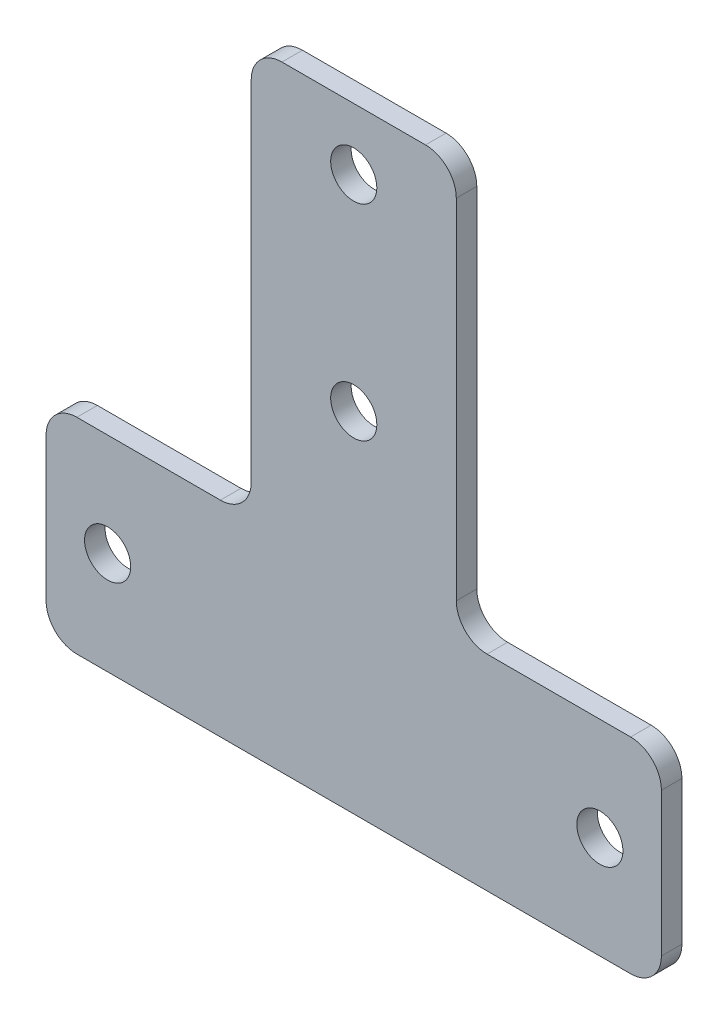
ISO-10303-21;
HEADER;
FILE_DESCRIPTION(('STEP AP214'),'2;1');
FILE_NAME('part.step','',(''),(''),'','','');
FILE_SCHEMA(('AUTOMOTIVE_DESIGN { 1 0 10303 214 1 1 1 1 }'));
ENDSEC;
DATA;
#1=APPLICATION_CONTEXT('core data for automotive mechanical design processes');
#2=APPLICATION_PROTOCOL_DEFINITION('international standard','automotive_design',2000,#1);
#3=PRODUCT_CONTEXT('',#1,'mechanical');
#4=PRODUCT('Part','Part','',(#3));
#5=PRODUCT_RELATED_PRODUCT_CATEGORY('part','',(#4));
#6=PRODUCT_DEFINITION_FORMATION('','',#4);
#7=PRODUCT_DEFINITION_CONTEXT('part definition',#1,'design');
#8=PRODUCT_DEFINITION('design','',#6,#7);
#9=PRODUCT_DEFINITION_SHAPE('','',#8);
#10=(LENGTH_UNIT() NAMED_UNIT(*) SI_UNIT(.MILLI.,.METRE.));
#11=(NAMED_UNIT(*) PLANE_ANGLE_UNIT() SI_UNIT($,.RADIAN.));
#12=(NAMED_UNIT(*) SI_UNIT($,.STERADIAN.) SOLID_ANGLE_UNIT());
#13=UNCERTAINTY_MEASURE_WITH_UNIT(LENGTH_MEASURE(1.E-05),#10,'distance_accuracy_value','');
#14=(GEOMETRIC_REPRESENTATION_CONTEXT(3) GLOBAL_UNCERTAINTY_ASSIGNED_CONTEXT((#13)) GLOBAL_UNIT_ASSIGNED_CONTEXT((#10,
#11,#12)) REPRESENTATION_CONTEXT('',''));
#15=CARTESIAN_POINT('',(0.,0.,0.));
#16=DIRECTION('',(0.,0.,1.));
#17=DIRECTION('',(1.,0.,0.));
#18=AXIS2_PLACEMENT_3D('',#15,#16,#17);
#19=CARTESIAN_POINT('',(13.,23.,-2.));
#20=DIRECTION('',(0.,0.,1.));
#21=DIRECTION('',(1.,0.,0.));
#22=AXIS2_PLACEMENT_3D('',#19,#20,#21);
#23=CYLINDRICAL_SURFACE('',#22,3.);
#24=CARTESIAN_POINT('',(13.,23.,0.));
#25=DIRECTION('',(0.,0.,-1.));
#26=DIRECTION('',(-1.,0.,0.));
#27=AXIS2_PLACEMENT_3D('',#24,#25,#26);
#28=CIRCLE('',#27,3.);
#29=CARTESIAN_POINT('',(13.,20.,0.));
#30=VERTEX_POINT('',#29);
#31=CARTESIAN_POINT('',(10.,23.,0.));
#32=VERTEX_POINT('',#31);
#33=EDGE_CURVE('E184',#30,#32,#28,.T.);
#34=ORIENTED_EDGE('',*,*,#33,.F.);
#35=DIRECTION('',(0.,0.,1.));
#36=VECTOR('',#35,1.);
#37=CARTESIAN_POINT('',(13.,20.,-2.));
#38=LINE('',#37,#36);
#39=CARTESIAN_POINT('',(13.,20.,-2.));
#40=VERTEX_POINT('',#39);
#41=EDGE_CURVE('E11',#40,#30,#38,.T.);
#42=ORIENTED_EDGE('',*,*,#41,.F.);
#43=CARTESIAN_POINT('',(13.,23.,-2.));
#44=DIRECTION('',(0.,0.,-1.));
#45=DIRECTION('',(-1.,0.,0.));
#46=AXIS2_PLACEMENT_3D('',#43,#44,#45);
#47=CIRCLE('',#46,3.);
#48=CARTESIAN_POINT('',(10.,23.,-2.));
#49=VERTEX_POINT('',#48);
#50=EDGE_CURVE('E229',#40,#49,#47,.T.);
#51=ORIENTED_EDGE('',*,*,#50,.T.);
#52=DIRECTION('',(0.,0.,1.));
#53=VECTOR('',#52,1.);
#54=CARTESIAN_POINT('',(10.,23.,-2.));
#55=LINE('',#54,#53);
#56=EDGE_CURVE('E43',#49,#32,#55,.T.);
#57=ORIENTED_EDGE('',*,*,#56,.T.);
#58=EDGE_LOOP('',(#34,#42,#51,#57));
#59=FACE_BOUND('',#58,.T.);
#60=ADVANCED_FACE('F40',(#59),#23,.F.);
#61=CARTESIAN_POINT('',(27.,20.,-2.));
#62=DIRECTION('',(0.,1.,0.));
#63=DIRECTION('',(-1.,0.,0.));
#64=AXIS2_PLACEMENT_3D('',#61,#62,#63);
#65=PLANE('',#64);
#66=DIRECTION('',(-1.,0.,0.));
#67=VECTOR('',#66,1.);
#68=CARTESIAN_POINT('',(27.,20.,0.));
#69=LINE('',#68,#67);
#70=CARTESIAN_POINT('',(27.,20.,0.));
#71=VERTEX_POINT('',#70);
#72=EDGE_CURVE('E227',#71,#30,#69,.T.);
#73=ORIENTED_EDGE('',*,*,#72,.F.);
#74=DIRECTION('',(0.,0.,1.));
#75=VECTOR('',#74,1.);
#76=CARTESIAN_POINT('',(27.,20.,-2.));
#77=LINE('',#76,#75);
#78=CARTESIAN_POINT('',(27.,20.,-2.));
#79=VERTEX_POINT('',#78);
#80=EDGE_CURVE('E49',#79,#71,#77,.T.);
#81=ORIENTED_EDGE('',*,*,#80,.F.);
#82=DIRECTION('',(-1.,0.,0.));
#83=VECTOR('',#82,1.);
#84=CARTESIAN_POINT('',(27.,20.,-2.));
#85=LINE('',#84,#83);
#86=EDGE_CURVE('E174',#79,#40,#85,.T.);
#87=ORIENTED_EDGE('',*,*,#86,.T.);
#88=ORIENTED_EDGE('',*,*,#41,.T.);
#89=EDGE_LOOP('',(#73,#81,#87,#88));
#90=FACE_BOUND('',#89,.T.);
#91=ADVANCED_FACE('F257',(#90),#65,.T.);
#92=CARTESIAN_POINT('',(27.,17.,-2.));
#93=DIRECTION('',(0.,0.,1.));
#94=DIRECTION('',(1.,0.,0.));
#95=AXIS2_PLACEMENT_3D('',#92,#93,#94);
#96=CYLINDRICAL_SURFACE('',#95,3.);
#97=CARTESIAN_POINT('',(27.,17.,0.));
#98=DIRECTION('',(0.,0.,1.));
#99=DIRECTION('',(1.,0.,0.));
#100=AXIS2_PLACEMENT_3D('',#97,#98,#99);
#101=CIRCLE('',#100,3.);
#102=CARTESIAN_POINT('',(30.,17.,0.));
#103=VERTEX_POINT('',#102);
#104=EDGE_CURVE('E161',#103,#71,#101,.T.);
#105=ORIENTED_EDGE('',*,*,#104,.F.);
#106=DIRECTION('',(0.,0.,1.));
#107=VECTOR('',#106,1.);
#108=CARTESIAN_POINT('',(30.,17.,-2.));
#109=LINE('',#108,#107);
#110=CARTESIAN_POINT('',(30.,17.,-2.));
#111=VERTEX_POINT('',#110);
#112=EDGE_CURVE('E156',#111,#103,#109,.T.);
#113=ORIENTED_EDGE('',*,*,#112,.F.);
#114=CARTESIAN_POINT('',(27.,17.,-2.));
#115=DIRECTION('',(0.,0.,1.));
#116=DIRECTION('',(1.,0.,0.));
#117=AXIS2_PLACEMENT_3D('',#114,#115,#116);
#118=CIRCLE('',#117,3.);
#119=EDGE_CURVE('E159',#111,#79,#118,.T.);
#120=ORIENTED_EDGE('',*,*,#119,.T.);
#121=ORIENTED_EDGE('',*,*,#80,.T.);
#122=EDGE_LOOP('',(#105,#113,#120,#121));
#123=FACE_BOUND('',#122,.T.);
#124=ADVANCED_FACE('F158',(#123),#96,.T.);
#125=CARTESIAN_POINT('',(30.,3.00000000000002,-2.));
#126=DIRECTION('',(1.,0.,0.));
#127=DIRECTION('',(0.,1.,0.));
#128=AXIS2_PLACEMENT_3D('',#125,#126,#127);
#129=PLANE('',#128);
#130=DIRECTION('',(0.,1.,0.));
#131=VECTOR('',#130,1.);
#132=CARTESIAN_POINT('',(30.,3.00000000000002,0.));
#133=LINE('',#132,#131);
#134=CARTESIAN_POINT('',(30.,3.00000000000002,0.));
#135=VERTEX_POINT('',#134);
#136=EDGE_CURVE('E224',#135,#103,#133,.T.);
#137=ORIENTED_EDGE('',*,*,#136,.F.);
#138=DIRECTION('',(0.,0.,1.));
#139=VECTOR('',#138,1.);
#140=CARTESIAN_POINT('',(30.,3.00000000000002,-2.));
#141=LINE('',#140,#139);
#142=CARTESIAN_POINT('',(30.,3.00000000000002,-2.));
#143=VERTEX_POINT('',#142);
#144=EDGE_CURVE('E166',#143,#135,#141,.T.);
#145=ORIENTED_EDGE('',*,*,#144,.F.);
#146=DIRECTION('',(0.,1.,0.));
#147=VECTOR('',#146,1.);
#148=CARTESIAN_POINT('',(30.,3.00000000000002,-2.));
#149=LINE('',#148,#147);
#150=EDGE_CURVE('E172',#143,#111,#149,.T.);
#151=ORIENTED_EDGE('',*,*,#150,.T.);
#152=ORIENTED_EDGE('',*,*,#112,.T.);
#153=EDGE_LOOP('',(#137,#145,#151,#152));
#154=FACE_BOUND('',#153,.T.);
#155=ADVANCED_FACE('F176',(#154),#129,.T.);
#156=CARTESIAN_POINT('',(27.,3.,-2.));
#157=DIRECTION('',(0.,0.,1.));
#158=DIRECTION('',(1.,0.,0.));
#159=AXIS2_PLACEMENT_3D('',#156,#157,#158);
#160=CYLINDRICAL_SURFACE('',#159,3.);
#161=CARTESIAN_POINT('',(27.,3.,0.));
#162=DIRECTION('',(0.,0.,1.));
#163=DIRECTION('',(1.,0.,0.));
#164=AXIS2_PLACEMENT_3D('',#161,#162,#163);
#165=CIRCLE('',#164,3.);
#166=CARTESIAN_POINT('',(27.,0.,0.));
#167=VERTEX_POINT('',#166);
#168=EDGE_CURVE('E221',#167,#135,#165,.T.);
#169=ORIENTED_EDGE('',*,*,#168,.F.);
#170=DIRECTION('',(0.,0.,1.));
#171=VECTOR('',#170,1.);
#172=CARTESIAN_POINT('',(27.,0.,-2.));
#173=LINE('',#172,#171);
#174=CARTESIAN_POINT('',(27.,0.,-2.));
#175=VERTEX_POINT('',#174);
#176=EDGE_CURVE('E233',#175,#167,#173,.T.);
#177=ORIENTED_EDGE('',*,*,#176,.F.);
#178=CARTESIAN_POINT('',(27.,3.,-2.));
#179=DIRECTION('',(0.,0.,1.));
#180=DIRECTION('',(1.,0.,0.));
#181=AXIS2_PLACEMENT_3D('',#178,#179,#180);
#182=CIRCLE('',#181,3.);
#183=EDGE_CURVE('E177',#175,#143,#182,.T.);
#184=ORIENTED_EDGE('',*,*,#183,.T.);
#185=ORIENTED_EDGE('',*,*,#144,.T.);
#186=EDGE_LOOP('',(#169,#177,#184,#185));
#187=FACE_BOUND('',#186,.T.);
#188=ADVANCED_FACE('F270',(#187),#160,.T.);
#189=CARTESIAN_POINT('',(-27.,0.,-2.));
#190=DIRECTION('',(0.,-1.,0.));
#191=DIRECTION('',(0.,0.,-1.));
#192=AXIS2_PLACEMENT_3D('',#189,#190,#191);
#193=PLANE('',#192);
#194=DIRECTION('',(1.,0.,0.));
#195=VECTOR('',#194,1.);
#196=CARTESIAN_POINT('',(-27.,0.,0.));
#197=LINE('',#196,#195);
#198=CARTESIAN_POINT('',(-27.,0.,0.));
#199=VERTEX_POINT('',#198);
#200=EDGE_CURVE('E218',#199,#167,#197,.T.);
#201=ORIENTED_EDGE('',*,*,#200,.F.);
#202=DIRECTION('',(0.,0.,1.));
#203=VECTOR('',#202,1.);
#204=CARTESIAN_POINT('',(-27.,0.,-2.));
#205=LINE('',#204,#203);
#206=CARTESIAN_POINT('',(-27.,0.,-2.));
#207=VERTEX_POINT('',#206);
#208=EDGE_CURVE('E235',#207,#199,#205,.T.);
#209=ORIENTED_EDGE('',*,*,#208,.F.);
#210=DIRECTION('',(1.,0.,0.));
#211=VECTOR('',#210,1.);
#212=CARTESIAN_POINT('',(-27.,0.,-2.));
#213=LINE('',#212,#211);
#214=EDGE_CURVE('E179',#207,#175,#213,.T.);
#215=ORIENTED_EDGE('',*,*,#214,.T.);
#216=ORIENTED_EDGE('',*,*,#176,.T.);
#217=EDGE_LOOP('',(#201,#209,#215,#216));
#218=FACE_BOUND('',#217,.T.);
#219=ADVANCED_FACE('F273',(#218),#193,.T.);
#220=CARTESIAN_POINT('',(-27.,3.,-2.));
#221=DIRECTION('',(0.,0.,1.));
#222=DIRECTION('',(1.,0.,0.));
#223=AXIS2_PLACEMENT_3D('',#220,#221,#222);
#224=CYLINDRICAL_SURFACE('',#223,3.);
#225=CARTESIAN_POINT('',(-27.,3.,0.));
#226=DIRECTION('',(0.,0.,1.));
#227=DIRECTION('',(-1.,0.,0.));
#228=AXIS2_PLACEMENT_3D('',#225,#226,#227);
#229=CIRCLE('',#228,3.);
#230=CARTESIAN_POINT('',(-30.,3.00000000000002,0.));
#231=VERTEX_POINT('',#230);
#232=EDGE_CURVE('E215',#231,#199,#229,.T.);
#233=ORIENTED_EDGE('',*,*,#232,.F.);
#234=DIRECTION('',(0.,0.,1.));
#235=VECTOR('',#234,1.);
#236=CARTESIAN_POINT('',(-30.,3.00000000000002,-2.));
#237=LINE('',#236,#235);
#238=CARTESIAN_POINT('',(-30.,3.00000000000002,-2.));
#239=VERTEX_POINT('',#238);
#240=EDGE_CURVE('E237',#239,#231,#237,.T.);
#241=ORIENTED_EDGE('',*,*,#240,.F.);
#242=CARTESIAN_POINT('',(-27.,3.,-2.));
#243=DIRECTION('',(0.,0.,1.));
#244=DIRECTION('',(-1.,0.,0.));
#245=AXIS2_PLACEMENT_3D('',#242,#243,#244);
#246=CIRCLE('',#245,3.);
#247=EDGE_CURVE('E396',#239,#207,#246,.T.);
#248=ORIENTED_EDGE('',*,*,#247,.T.);
#249=ORIENTED_EDGE('',*,*,#208,.T.);
#250=EDGE_LOOP('',(#233,#241,#248,#249));
#251=FACE_BOUND('',#250,.T.);
#252=ADVANCED_FACE('F277',(#251),#224,.T.);
#253=CARTESIAN_POINT('',(-30.,17.,-2.));
#254=DIRECTION('',(-1.,0.,0.));
#255=DIRECTION('',(0.,0.,1.));
#256=AXIS2_PLACEMENT_3D('',#253,#254,#255);
#257=PLANE('',#256);
#258=DIRECTION('',(0.,-1.,0.));
#259=VECTOR('',#258,1.);
#260=CARTESIAN_POINT('',(-30.,17.,0.));
#261=LINE('',#260,#259);
#262=CARTESIAN_POINT('',(-30.,17.,0.));
#263=VERTEX_POINT('',#262);
#264=EDGE_CURVE('E212',#263,#231,#261,.T.);
#265=ORIENTED_EDGE('',*,*,#264,.F.);
#266=DIRECTION('',(0.,0.,1.));
#267=VECTOR('',#266,1.);
#268=CARTESIAN_POINT('',(-30.,17.,-2.));
#269=LINE('',#268,#267);
#270=CARTESIAN_POINT('',(-30.,17.,-2.));
#271=VERTEX_POINT('',#270);
#272=EDGE_CURVE('E239',#271,#263,#269,.T.);
#273=ORIENTED_EDGE('',*,*,#272,.F.);
#274=DIRECTION('',(0.,-1.,0.));
#275=VECTOR('',#274,1.);
#276=CARTESIAN_POINT('',(-30.,17.,-2.));
#277=LINE('',#276,#275);
#278=EDGE_CURVE('E393',#271,#239,#277,.T.);
#279=ORIENTED_EDGE('',*,*,#278,.T.);
#280=ORIENTED_EDGE('',*,*,#240,.T.);
#281=EDGE_LOOP('',(#265,#273,#279,#280));
#282=FACE_BOUND('',#281,.T.);
#283=ADVANCED_FACE('F281',(#282),#257,.T.);
#284=CARTESIAN_POINT('',(-27.,17.,-2.));
#285=DIRECTION('',(0.,0.,1.));
#286=DIRECTION('',(1.,0.,0.));
#287=AXIS2_PLACEMENT_3D('',#284,#285,#286);
#288=CYLINDRICAL_SURFACE('',#287,3.);
#289=CARTESIAN_POINT('',(-27.,17.,0.));
#290=DIRECTION('',(0.,0.,1.));
#291=DIRECTION('',(1.,0.,0.));
#292=AXIS2_PLACEMENT_3D('',#289,#290,#291);
#293=CIRCLE('',#292,3.);
#294=CARTESIAN_POINT('',(-27.,20.,0.));
#295=VERTEX_POINT('',#294);
#296=EDGE_CURVE('E209',#295,#263,#293,.T.);
#297=ORIENTED_EDGE('',*,*,#296,.F.);
#298=DIRECTION('',(0.,0.,1.));
#299=VECTOR('',#298,1.);
#300=CARTESIAN_POINT('',(-27.,20.,-2.));
#301=LINE('',#300,#299);
#302=CARTESIAN_POINT('',(-27.,20.,-2.));
#303=VERTEX_POINT('',#302);
#304=EDGE_CURVE('E241',#303,#295,#301,.T.);
#305=ORIENTED_EDGE('',*,*,#304,.F.);
#306=CARTESIAN_POINT('',(-27.,17.,-2.));
#307=DIRECTION('',(0.,0.,1.));
#308=DIRECTION('',(1.,0.,0.));
#309=AXIS2_PLACEMENT_3D('',#306,#307,#308);
#310=CIRCLE('',#309,3.);
#311=EDGE_CURVE('E390',#303,#271,#310,.T.);
#312=ORIENTED_EDGE('',*,*,#311,.T.);
#313=ORIENTED_EDGE('',*,*,#272,.T.);
#314=EDGE_LOOP('',(#297,#305,#312,#313));
#315=FACE_BOUND('',#314,.T.);
#316=ADVANCED_FACE('F285',(#315),#288,.T.);
#317=CARTESIAN_POINT('',(-13.,20.,-2.));
#318=DIRECTION('',(0.,1.,0.));
#319=DIRECTION('',(-1.,0.,0.));
#320=AXIS2_PLACEMENT_3D('',#317,#318,#319);
#321=PLANE('',#320);
#322=DIRECTION('',(-1.,0.,0.));
#323=VECTOR('',#322,1.);
#324=CARTESIAN_POINT('',(-13.,20.,0.));
#325=LINE('',#324,#323);
#326=CARTESIAN_POINT('',(-13.,20.,0.));
#327=VERTEX_POINT('',#326);
#328=EDGE_CURVE('E206',#327,#295,#325,.T.);
#329=ORIENTED_EDGE('',*,*,#328,.F.);
#330=DIRECTION('',(0.,0.,1.));
#331=VECTOR('',#330,1.);
#332=CARTESIAN_POINT('',(-13.,20.,-2.));
#333=LINE('',#332,#331);
#334=CARTESIAN_POINT('',(-13.,20.,-2.));
#335=VERTEX_POINT('',#334);
#336=EDGE_CURVE('E243',#335,#327,#333,.T.);
#337=ORIENTED_EDGE('',*,*,#336,.F.);
#338=DIRECTION('',(-1.,0.,0.));
#339=VECTOR('',#338,1.);
#340=CARTESIAN_POINT('',(-13.,20.,-2.));
#341=LINE('',#340,#339);
#342=EDGE_CURVE('E387',#335,#303,#341,.T.);
#343=ORIENTED_EDGE('',*,*,#342,.T.);
#344=ORIENTED_EDGE('',*,*,#304,.T.);
#345=EDGE_LOOP('',(#329,#337,#343,#344));
#346=FACE_BOUND('',#345,.T.);
#347=ADVANCED_FACE('F289',(#346),#321,.T.);
#348=CARTESIAN_POINT('',(-13.,23.,-2.));
#349=DIRECTION('',(0.,0.,1.));
#350=DIRECTION('',(1.,0.,0.));
#351=AXIS2_PLACEMENT_3D('',#348,#349,#350);
#352=CYLINDRICAL_SURFACE('',#351,3.);
#353=CARTESIAN_POINT('',(-13.,23.,0.));
#354=DIRECTION('',(0.,0.,-1.));
#355=DIRECTION('',(-1.,0.,0.));
#356=AXIS2_PLACEMENT_3D('',#353,#354,#355);
#357=CIRCLE('',#356,3.);
#358=CARTESIAN_POINT('',(-9.99999999999999,23.,0.));
#359=VERTEX_POINT('',#358);
#360=EDGE_CURVE('E203',#359,#327,#357,.T.);
#361=ORIENTED_EDGE('',*,*,#360,.F.);
#362=DIRECTION('',(0.,0.,1.));
#363=VECTOR('',#362,1.);
#364=CARTESIAN_POINT('',(-9.99999999999999,23.,-2.));
#365=LINE('',#364,#363);
#366=CARTESIAN_POINT('',(-9.99999999999999,23.,-2.));
#367=VERTEX_POINT('',#366);
#368=EDGE_CURVE('E245',#367,#359,#365,.T.);
#369=ORIENTED_EDGE('',*,*,#368,.F.);
#370=CARTESIAN_POINT('',(-13.,23.,-2.));
#371=DIRECTION('',(0.,0.,-1.));
#372=DIRECTION('',(-1.,0.,0.));
#373=AXIS2_PLACEMENT_3D('',#370,#371,#372);
#374=CIRCLE('',#373,3.);
#375=EDGE_CURVE('E384',#367,#335,#374,.T.);
#376=ORIENTED_EDGE('',*,*,#375,.T.);
#377=ORIENTED_EDGE('',*,*,#336,.T.);
#378=EDGE_LOOP('',(#361,#369,#376,#377));
#379=FACE_BOUND('',#378,.T.);
#380=ADVANCED_FACE('F293',(#379),#352,.F.);
#381=CARTESIAN_POINT('',(-10.,57.,-2.));
#382=DIRECTION('',(-1.,0.,0.));
#383=DIRECTION('',(0.,-1.,0.));
#384=AXIS2_PLACEMENT_3D('',#381,#382,#383);
#385=PLANE('',#384);
#386=DIRECTION('',(0.,-1.,0.));
#387=VECTOR('',#386,1.);
#388=CARTESIAN_POINT('',(-10.,57.,0.));
#389=LINE('',#388,#387);
#390=CARTESIAN_POINT('',(-10.,57.,0.));
#391=VERTEX_POINT('',#390);
#392=EDGE_CURVE('E200',#391,#359,#389,.T.);
#393=ORIENTED_EDGE('',*,*,#392,.F.);
#394=DIRECTION('',(0.,0.,1.));
#395=VECTOR('',#394,1.);
#396=CARTESIAN_POINT('',(-10.,57.,-2.));
#397=LINE('',#396,#395);
#398=CARTESIAN_POINT('',(-10.,57.,-2.));
#399=VERTEX_POINT('',#398);
#400=EDGE_CURVE('E247',#399,#391,#397,.T.);
#401=ORIENTED_EDGE('',*,*,#400,.F.);
#402=DIRECTION('',(0.,-1.,0.));
#403=VECTOR('',#402,1.);
#404=CARTESIAN_POINT('',(-10.,57.,-2.));
#405=LINE('',#404,#403);
#406=EDGE_CURVE('E381',#399,#367,#405,.T.);
#407=ORIENTED_EDGE('',*,*,#406,.T.);
#408=ORIENTED_EDGE('',*,*,#368,.T.);
#409=EDGE_LOOP('',(#393,#401,#407,#408));
#410=FACE_BOUND('',#409,.T.);
#411=ADVANCED_FACE('F297',(#410),#385,.T.);
#412=CARTESIAN_POINT('',(-7.,57.,-2.));
#413=DIRECTION('',(0.,0.,1.));
#414=DIRECTION('',(1.,0.,0.));
#415=AXIS2_PLACEMENT_3D('',#412,#413,#414);
#416=CYLINDRICAL_SURFACE('',#415,3.00000000000001);
#417=CARTESIAN_POINT('',(-7.,57.,0.));
#418=DIRECTION('',(0.,0.,1.));
#419=DIRECTION('',(1.,0.,0.));
#420=AXIS2_PLACEMENT_3D('',#417,#418,#419);
#421=CIRCLE('',#420,3.00000000000001);
#422=CARTESIAN_POINT('',(-7.,60.,0.));
#423=VERTEX_POINT('',#422);
#424=EDGE_CURVE('E197',#423,#391,#421,.T.);
#425=ORIENTED_EDGE('',*,*,#424,.F.);
#426=DIRECTION('',(0.,0.,1.));
#427=VECTOR('',#426,1.);
#428=CARTESIAN_POINT('',(-7.,60.,-2.));
#429=LINE('',#428,#427);
#430=CARTESIAN_POINT('',(-7.,60.,-2.));
#431=VERTEX_POINT('',#430);
#432=EDGE_CURVE('E249',#431,#423,#429,.T.);
#433=ORIENTED_EDGE('',*,*,#432,.F.);
#434=CARTESIAN_POINT('',(-7.,57.,-2.));
#435=DIRECTION('',(0.,0.,1.));
#436=DIRECTION('',(1.,0.,0.));
#437=AXIS2_PLACEMENT_3D('',#434,#435,#436);
#438=CIRCLE('',#437,3.00000000000001);
#439=EDGE_CURVE('E378',#431,#399,#438,.T.);
#440=ORIENTED_EDGE('',*,*,#439,.T.);
#441=ORIENTED_EDGE('',*,*,#400,.T.);
#442=EDGE_LOOP('',(#425,#433,#440,#441));
#443=FACE_BOUND('',#442,.T.);
#444=ADVANCED_FACE('F301',(#443),#416,.T.);
#445=CARTESIAN_POINT('',(7.,60.,-2.));
#446=DIRECTION('',(0.,1.,0.));
#447=DIRECTION('',(-1.,0.,0.));
#448=AXIS2_PLACEMENT_3D('',#445,#446,#447);
#449=PLANE('',#448);
#450=DIRECTION('',(-1.,0.,0.));
#451=VECTOR('',#450,1.);
#452=CARTESIAN_POINT('',(7.,60.,0.));
#453=LINE('',#452,#451);
#454=CARTESIAN_POINT('',(7.,60.,0.));
#455=VERTEX_POINT('',#454);
#456=EDGE_CURVE('E194',#455,#423,#453,.T.);
#457=ORIENTED_EDGE('',*,*,#456,.F.);
#458=DIRECTION('',(0.,0.,1.));
#459=VECTOR('',#458,1.);
#460=CARTESIAN_POINT('',(7.,60.,-2.));
#461=LINE('',#460,#459);
#462=CARTESIAN_POINT('',(7.,60.,-2.));
#463=VERTEX_POINT('',#462);
#464=EDGE_CURVE('E251',#463,#455,#461,.T.);
#465=ORIENTED_EDGE('',*,*,#464,.F.);
#466=DIRECTION('',(-1.,0.,0.));
#467=VECTOR('',#466,1.);
#468=CARTESIAN_POINT('',(7.,60.,-2.));
#469=LINE('',#468,#467);
#470=EDGE_CURVE('E375',#463,#431,#469,.T.);
#471=ORIENTED_EDGE('',*,*,#470,.T.);
#472=ORIENTED_EDGE('',*,*,#432,.T.);
#473=EDGE_LOOP('',(#457,#465,#471,#472));
#474=FACE_BOUND('',#473,.T.);
#475=ADVANCED_FACE('F305',(#474),#449,.T.);
#476=CARTESIAN_POINT('',(7.,57.,-2.));
#477=DIRECTION('',(0.,0.,1.));
#478=DIRECTION('',(1.,0.,0.));
#479=AXIS2_PLACEMENT_3D('',#476,#477,#478);
#480=CYLINDRICAL_SURFACE('',#479,3.);
#481=CARTESIAN_POINT('',(7.,57.,0.));
#482=DIRECTION('',(0.,0.,1.));
#483=DIRECTION('',(-1.,0.,0.));
#484=AXIS2_PLACEMENT_3D('',#481,#482,#483);
#485=CIRCLE('',#484,3.);
#486=CARTESIAN_POINT('',(10.,57.,0.));
#487=VERTEX_POINT('',#486);
#488=EDGE_CURVE('E191',#487,#455,#485,.T.);
#489=ORIENTED_EDGE('',*,*,#488,.F.);
#490=DIRECTION('',(0.,0.,1.));
#491=VECTOR('',#490,1.);
#492=CARTESIAN_POINT('',(10.,57.,-2.));
#493=LINE('',#492,#491);
#494=CARTESIAN_POINT('',(10.,57.,-2.));
#495=VERTEX_POINT('',#494);
#496=EDGE_CURVE('E252',#495,#487,#493,.T.);
#497=ORIENTED_EDGE('',*,*,#496,.F.);
#498=CARTESIAN_POINT('',(7.,57.,-2.));
#499=DIRECTION('',(0.,0.,1.));
#500=DIRECTION('',(-1.,0.,0.));
#501=AXIS2_PLACEMENT_3D('',#498,#499,#500);
#502=CIRCLE('',#501,3.);
#503=EDGE_CURVE('E372',#495,#463,#502,.T.);
#504=ORIENTED_EDGE('',*,*,#503,.T.);
#505=ORIENTED_EDGE('',*,*,#464,.T.);
#506=EDGE_LOOP('',(#489,#497,#504,#505));
#507=FACE_BOUND('',#506,.T.);
#508=ADVANCED_FACE('F309',(#507),#480,.T.);
#509=CARTESIAN_POINT('',(10.,32.5,-2.));
#510=DIRECTION('',(1.,0.,0.));
#511=DIRECTION('',(0.,1.,0.));
#512=AXIS2_PLACEMENT_3D('',#509,#510,#511);
#513=PLANE('',#512);
#514=DIRECTION('',(0.,1.,0.));
#515=VECTOR('',#514,1.);
#516=CARTESIAN_POINT('',(10.,32.5,0.));
#517=LINE('',#516,#515);
#518=EDGE_CURVE('E187',#32,#487,#517,.T.);
#519=ORIENTED_EDGE('',*,*,#518,.F.);
#520=ORIENTED_EDGE('',*,*,#56,.F.);
#521=DIRECTION('',(0.,1.,0.));
#522=VECTOR('',#521,1.);
#523=CARTESIAN_POINT('',(10.,23.,-2.));
#524=LINE('',#523,#522);
#525=EDGE_CURVE('E370',#49,#495,#524,.T.);
#526=ORIENTED_EDGE('',*,*,#525,.T.);
#527=ORIENTED_EDGE('',*,*,#496,.T.);
#528=EDGE_LOOP('',(#519,#520,#526,#527));
#529=FACE_BOUND('',#528,.T.);
#530=ADVANCED_FACE('F312',(#529),#513,.T.);
#531=CARTESIAN_POINT('',(13.,23.,-2.));
#532=DIRECTION('',(0.,0.,-1.));
#533=DIRECTION('',(-1.,0.,0.));
#534=AXIS2_PLACEMENT_3D('',#531,#532,#533);
#535=PLANE('',#534);
#536=CARTESIAN_POINT('',(0.,34.,-2.));
#537=DIRECTION('',(0.,0.,1.));
#538=DIRECTION('',(1.,0.,0.));
#539=AXIS2_PLACEMENT_3D('',#536,#537,#538);
#540=CIRCLE('',#539,2.25);
#541=CARTESIAN_POINT('',(2.25,34.,-2.));
#542=VERTEX_POINT('',#541);
#543=EDGE_CURVE('E345',#542,#542,#540,.T.);
#544=ORIENTED_EDGE('',*,*,#543,.T.);
#545=EDGE_LOOP('',(#544));
#546=FACE_BOUND('',#545,.T.);
#547=CARTESIAN_POINT('',(24.,10.,-2.));
#548=DIRECTION('',(0.,0.,1.));
#549=DIRECTION('',(-1.,0.,0.));
#550=AXIS2_PLACEMENT_3D('',#547,#548,#549);
#551=CIRCLE('',#550,2.25);
#552=CARTESIAN_POINT('',(21.75,10.,-2.));
#553=VERTEX_POINT('',#552);
#554=EDGE_CURVE('E353',#553,#553,#551,.T.);
#555=ORIENTED_EDGE('',*,*,#554,.T.);
#556=EDGE_LOOP('',(#555));
#557=FACE_BOUND('',#556,.T.);
#558=CARTESIAN_POINT('',(-24.,10.,-2.));
#559=DIRECTION('',(0.,0.,1.));
#560=DIRECTION('',(1.,0.,0.));
#561=AXIS2_PLACEMENT_3D('',#558,#559,#560);
#562=CIRCLE('',#561,2.25);
#563=CARTESIAN_POINT('',(-21.75,10.,-2.));
#564=VERTEX_POINT('',#563);
#565=EDGE_CURVE('E359',#564,#564,#562,.T.);
#566=ORIENTED_EDGE('',*,*,#565,.T.);
#567=EDGE_LOOP('',(#566));
#568=FACE_BOUND('',#567,.T.);
#569=CARTESIAN_POINT('',(0.,54.,-2.));
#570=DIRECTION('',(0.,0.,1.));
#571=DIRECTION('',(1.,0.,0.));
#572=AXIS2_PLACEMENT_3D('',#569,#570,#571);
#573=CIRCLE('',#572,2.25);
#574=CARTESIAN_POINT('',(2.25,54.,-2.));
#575=VERTEX_POINT('',#574);
#576=EDGE_CURVE('E188',#575,#575,#573,.T.);
#577=ORIENTED_EDGE('',*,*,#576,.T.);
#578=EDGE_LOOP('',(#577));
#579=FACE_BOUND('',#578,.T.);
#580=ORIENTED_EDGE('',*,*,#50,.F.);
#581=ORIENTED_EDGE('',*,*,#86,.F.);
#582=ORIENTED_EDGE('',*,*,#119,.F.);
#583=ORIENTED_EDGE('',*,*,#150,.F.);
#584=ORIENTED_EDGE('',*,*,#183,.F.);
#585=ORIENTED_EDGE('',*,*,#214,.F.);
#586=ORIENTED_EDGE('',*,*,#247,.F.);
#587=ORIENTED_EDGE('',*,*,#278,.F.);
#588=ORIENTED_EDGE('',*,*,#311,.F.);
#589=ORIENTED_EDGE('',*,*,#342,.F.);
#590=ORIENTED_EDGE('',*,*,#375,.F.);
#591=ORIENTED_EDGE('',*,*,#406,.F.);
#592=ORIENTED_EDGE('',*,*,#439,.F.);
#593=ORIENTED_EDGE('',*,*,#470,.F.);
#594=ORIENTED_EDGE('',*,*,#503,.F.);
#595=ORIENTED_EDGE('',*,*,#525,.F.);
#596=EDGE_LOOP('',(#580,#581,#582,#583,#584,#585,#586,#587,#588,#589,#590,#591,#592,#593,#594,#595));
#597=FACE_BOUND('',#596,.T.);
#598=ADVANCED_FACE('F170',(#546,#557,#568,#579,#597),#535,.T.);
#599=CARTESIAN_POINT('',(13.,23.,0.));
#600=DIRECTION('',(0.,0.,-1.));
#601=DIRECTION('',(-1.,0.,0.));
#602=AXIS2_PLACEMENT_3D('',#599,#600,#601);
#603=PLANE('',#602);
#604=CARTESIAN_POINT('',(0.,34.,0.));
#605=DIRECTION('',(0.,0.,1.));
#606=DIRECTION('',(1.,0.,0.));
#607=AXIS2_PLACEMENT_3D('',#604,#605,#606);
#608=CIRCLE('',#607,2.25);
#609=CARTESIAN_POINT('',(2.25,34.,0.));
#610=VERTEX_POINT('',#609);
#611=EDGE_CURVE('E348',#610,#610,#608,.T.);
#612=ORIENTED_EDGE('',*,*,#611,.F.);
#613=EDGE_LOOP('',(#612));
#614=FACE_BOUND('',#613,.T.);
#615=CARTESIAN_POINT('',(24.,10.,0.));
#616=DIRECTION('',(0.,0.,1.));
#617=DIRECTION('',(-1.,0.,0.));
#618=AXIS2_PLACEMENT_3D('',#615,#616,#617);
#619=CIRCLE('',#618,2.25);
#620=CARTESIAN_POINT('',(21.75,10.,0.));
#621=VERTEX_POINT('',#620);
#622=EDGE_CURVE('E350',#621,#621,#619,.T.);
#623=ORIENTED_EDGE('',*,*,#622,.F.);
#624=EDGE_LOOP('',(#623));
#625=FACE_BOUND('',#624,.T.);
#626=CARTESIAN_POINT('',(-24.,10.,0.));
#627=DIRECTION('',(0.,0.,1.));
#628=DIRECTION('',(1.,0.,0.));
#629=AXIS2_PLACEMENT_3D('',#626,#627,#628);
#630=CIRCLE('',#629,2.25);
#631=CARTESIAN_POINT('',(-21.75,10.,0.));
#632=VERTEX_POINT('',#631);
#633=EDGE_CURVE('E356',#632,#632,#630,.T.);
#634=ORIENTED_EDGE('',*,*,#633,.F.);
#635=EDGE_LOOP('',(#634));
#636=FACE_BOUND('',#635,.T.);
#637=CARTESIAN_POINT('',(0.,54.,0.));
#638=DIRECTION('',(0.,0.,1.));
#639=DIRECTION('',(1.,0.,0.));
#640=AXIS2_PLACEMENT_3D('',#637,#638,#639);
#641=CIRCLE('',#640,2.25);
#642=CARTESIAN_POINT('',(2.25,54.,0.));
#643=VERTEX_POINT('',#642);
#644=EDGE_CURVE('E362',#643,#643,#641,.T.);
#645=ORIENTED_EDGE('',*,*,#644,.F.);
#646=EDGE_LOOP('',(#645));
#647=FACE_BOUND('',#646,.T.);
#648=ORIENTED_EDGE('',*,*,#33,.T.);
#649=ORIENTED_EDGE('',*,*,#518,.T.);
#650=ORIENTED_EDGE('',*,*,#488,.T.);
#651=ORIENTED_EDGE('',*,*,#456,.T.);
#652=ORIENTED_EDGE('',*,*,#424,.T.);
#653=ORIENTED_EDGE('',*,*,#392,.T.);
#654=ORIENTED_EDGE('',*,*,#360,.T.);
#655=ORIENTED_EDGE('',*,*,#328,.T.);
#656=ORIENTED_EDGE('',*,*,#296,.T.);
#657=ORIENTED_EDGE('',*,*,#264,.T.);
#658=ORIENTED_EDGE('',*,*,#232,.T.);
#659=ORIENTED_EDGE('',*,*,#200,.T.);
#660=ORIENTED_EDGE('',*,*,#168,.T.);
#661=ORIENTED_EDGE('',*,*,#136,.T.);
#662=ORIENTED_EDGE('',*,*,#104,.T.);
#663=ORIENTED_EDGE('',*,*,#72,.T.);
#664=EDGE_LOOP('',(#648,#649,#650,#651,#652,#653,#654,#655,#656,#657,#658,#659,#660,#661,#662,#663));
#665=FACE_BOUND('',#664,.T.);
#666=ADVANCED_FACE('F256',(#614,#625,#636,#647,#665),#603,.F.);
#667=CARTESIAN_POINT('',(0.,54.,-2.));
#668=DIRECTION('',(0.,0.,1.));
#669=DIRECTION('',(1.,0.,0.));
#670=AXIS2_PLACEMENT_3D('',#667,#668,#669);
#671=CYLINDRICAL_SURFACE('',#670,2.25);
#672=ORIENTED_EDGE('',*,*,#576,.F.);
#673=EDGE_LOOP('',(#672));
#674=FACE_BOUND('',#673,.T.);
#675=ORIENTED_EDGE('',*,*,#644,.T.);
#676=EDGE_LOOP('',(#675));
#677=FACE_BOUND('',#676,.T.);
#678=ADVANCED_FACE('F322',(#674,#677),#671,.F.);
#679=CARTESIAN_POINT('',(-24.,10.,-2.));
#680=DIRECTION('',(0.,0.,1.));
#681=DIRECTION('',(1.,0.,0.));
#682=AXIS2_PLACEMENT_3D('',#679,#680,#681);
#683=CYLINDRICAL_SURFACE('',#682,2.25);
#684=ORIENTED_EDGE('',*,*,#565,.F.);
#685=EDGE_LOOP('',(#684));
#686=FACE_BOUND('',#685,.T.);
#687=ORIENTED_EDGE('',*,*,#633,.T.);
#688=EDGE_LOOP('',(#687));
#689=FACE_BOUND('',#688,.T.);
#690=ADVANCED_FACE('F329',(#686,#689),#683,.F.);
#691=CARTESIAN_POINT('',(24.,10.,-2.));
#692=DIRECTION('',(0.,0.,1.));
#693=DIRECTION('',(1.,0.,0.));
#694=AXIS2_PLACEMENT_3D('',#691,#692,#693);
#695=CYLINDRICAL_SURFACE('',#694,2.25);
#696=ORIENTED_EDGE('',*,*,#554,.F.);
#697=EDGE_LOOP('',(#696));
#698=FACE_BOUND('',#697,.T.);
#699=ORIENTED_EDGE('',*,*,#622,.T.);
#700=EDGE_LOOP('',(#699));
#701=FACE_BOUND('',#700,.T.);
#702=ADVANCED_FACE('F333',(#698,#701),#695,.F.);
#703=CARTESIAN_POINT('',(0.,34.,-2.));
#704=DIRECTION('',(0.,0.,1.));
#705=DIRECTION('',(1.,0.,0.));
#706=AXIS2_PLACEMENT_3D('',#703,#704,#705);
#707=CYLINDRICAL_SURFACE('',#706,2.25);
#708=ORIENTED_EDGE('',*,*,#543,.F.);
#709=EDGE_LOOP('',(#708));
#710=FACE_BOUND('',#709,.T.);
#711=ORIENTED_EDGE('',*,*,#611,.T.);
#712=EDGE_LOOP('',(#711));
#713=FACE_BOUND('',#712,.T.);
#714=ADVANCED_FACE('F337',(#710,#713),#707,.F.);
#715=CLOSED_SHELL('',(#60,#91,#124,#155,#188,#219,#252,#283,#316,#347,#380,#411,#444,#475,#508,
#530,#598,#666,#678,#690,#702,#714));
#716=MANIFOLD_SOLID_BREP('B2',#715);
#717=ADVANCED_BREP_SHAPE_REPRESENTATION('',(#18,#716),#14);
#718=SHAPE_DEFINITION_REPRESENTATION(#9,#717);
ENDSEC;
END-ISO-10303-21;
